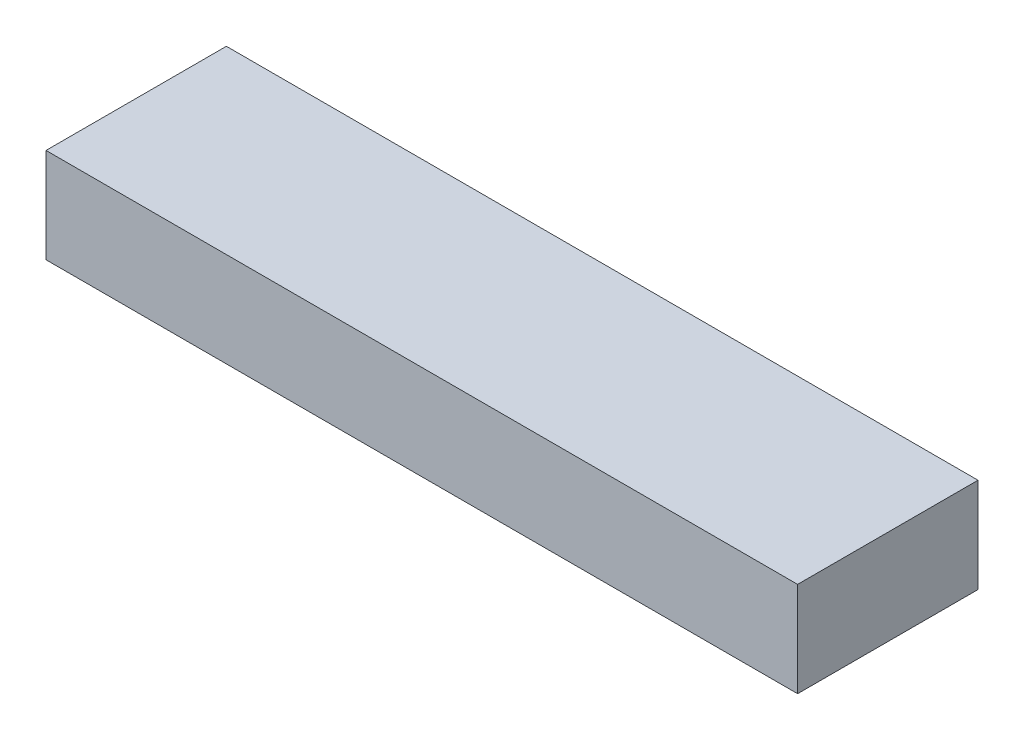
ISO-10303-21;
HEADER;
FILE_DESCRIPTION(('STEP AP214'),'2;1');
FILE_NAME('part.step','',(''),(''),'','','');
FILE_SCHEMA(('AUTOMOTIVE_DESIGN { 1 0 10303 214 1 1 1 1 }'));
ENDSEC;
DATA;
#1=APPLICATION_CONTEXT('core data for automotive mechanical design processes');
#2=APPLICATION_PROTOCOL_DEFINITION('international standard','automotive_design',2000,#1);
#3=PRODUCT_CONTEXT('',#1,'mechanical');
#4=PRODUCT('Part','Part','',(#3));
#5=PRODUCT_RELATED_PRODUCT_CATEGORY('part','',(#4));
#6=PRODUCT_DEFINITION_FORMATION('','',#4);
#7=PRODUCT_DEFINITION_CONTEXT('part definition',#1,'design');
#8=PRODUCT_DEFINITION('design','',#6,#7);
#9=PRODUCT_DEFINITION_SHAPE('','',#8);
#10=(LENGTH_UNIT() NAMED_UNIT(*) SI_UNIT(.MILLI.,.METRE.));
#11=(NAMED_UNIT(*) PLANE_ANGLE_UNIT() SI_UNIT($,.RADIAN.));
#12=(NAMED_UNIT(*) SI_UNIT($,.STERADIAN.) SOLID_ANGLE_UNIT());
#13=UNCERTAINTY_MEASURE_WITH_UNIT(LENGTH_MEASURE(1.E-05),#10,'distance_accuracy_value','');
#14=(GEOMETRIC_REPRESENTATION_CONTEXT(3) GLOBAL_UNCERTAINTY_ASSIGNED_CONTEXT((#13)) GLOBAL_UNIT_ASSIGNED_CONTEXT((#10,
#11,#12)) REPRESENTATION_CONTEXT('',''));
#15=CARTESIAN_POINT('',(0.,0.,0.));
#16=DIRECTION('',(0.,0.,1.));
#17=DIRECTION('',(1.,0.,0.));
#18=AXIS2_PLACEMENT_3D('',#15,#16,#17);
#19=CARTESIAN_POINT('',(12.5,3.15,-3.));
#20=DIRECTION('',(-1.,0.,0.));
#21=DIRECTION('',(0.,0.,1.));
#22=AXIS2_PLACEMENT_3D('',#19,#20,#21);
#23=PLANE('',#22);
#24=DIRECTION('',(0.,0.,-1.));
#25=VECTOR('',#24,1.);
#26=CARTESIAN_POINT('',(12.5,0.,-3.));
#27=LINE('',#26,#25);
#28=CARTESIAN_POINT('',(12.5,0.,3.));
#29=VERTEX_POINT('',#28);
#30=CARTESIAN_POINT('',(12.5,0.,-3.));
#31=VERTEX_POINT('',#30);
#32=EDGE_CURVE('E95',#29,#31,#27,.T.);
#33=ORIENTED_EDGE('',*,*,#32,.T.);
#34=DIRECTION('',(0.,-1.,0.));
#35=VECTOR('',#34,1.);
#36=CARTESIAN_POINT('',(12.5,3.15,-3.));
#37=LINE('',#36,#35);
#38=CARTESIAN_POINT('',(12.5,3.15,-3.));
#39=VERTEX_POINT('',#38);
#40=EDGE_CURVE('E11',#39,#31,#37,.T.);
#41=ORIENTED_EDGE('',*,*,#40,.F.);
#42=DIRECTION('',(0.,0.,-1.));
#43=VECTOR('',#42,1.);
#44=CARTESIAN_POINT('',(12.5,3.15,-3.));
#45=LINE('',#44,#43);
#46=CARTESIAN_POINT('',(12.5,3.15,3.));
#47=VERTEX_POINT('',#46);
#48=EDGE_CURVE('E83',#47,#39,#45,.T.);
#49=ORIENTED_EDGE('',*,*,#48,.F.);
#50=DIRECTION('',(0.,-1.,0.));
#51=VECTOR('',#50,1.);
#52=CARTESIAN_POINT('',(12.5,3.15,3.));
#53=LINE('',#52,#51);
#54=EDGE_CURVE('E91',#47,#29,#53,.T.);
#55=ORIENTED_EDGE('',*,*,#54,.T.);
#56=EDGE_LOOP('',(#33,#41,#49,#55));
#57=FACE_BOUND('',#56,.T.);
#58=ADVANCED_FACE('F32',(#57),#23,.F.);
#59=CARTESIAN_POINT('',(-12.5,3.15,-3.));
#60=DIRECTION('',(0.,0.,1.));
#61=DIRECTION('',(1.,0.,0.));
#62=AXIS2_PLACEMENT_3D('',#59,#60,#61);
#63=PLANE('',#62);
#64=DIRECTION('',(-1.,0.,0.));
#65=VECTOR('',#64,1.);
#66=CARTESIAN_POINT('',(-12.5,0.,-3.));
#67=LINE('',#66,#65);
#68=CARTESIAN_POINT('',(-12.5,0.,-3.));
#69=VERTEX_POINT('',#68);
#70=EDGE_CURVE('E87',#31,#69,#67,.T.);
#71=ORIENTED_EDGE('',*,*,#70,.T.);
#72=DIRECTION('',(0.,-1.,0.));
#73=VECTOR('',#72,1.);
#74=CARTESIAN_POINT('',(-12.5,3.15,-3.));
#75=LINE('',#74,#73);
#76=CARTESIAN_POINT('',(-12.5,3.15,-3.));
#77=VERTEX_POINT('',#76);
#78=EDGE_CURVE('E40',#77,#69,#75,.T.);
#79=ORIENTED_EDGE('',*,*,#78,.F.);
#80=DIRECTION('',(-1.,0.,0.));
#81=VECTOR('',#80,1.);
#82=CARTESIAN_POINT('',(-12.5,3.15,-3.));
#83=LINE('',#82,#81);
#84=EDGE_CURVE('E78',#39,#77,#83,.T.);
#85=ORIENTED_EDGE('',*,*,#84,.F.);
#86=ORIENTED_EDGE('',*,*,#40,.T.);
#87=EDGE_LOOP('',(#71,#79,#85,#86));
#88=FACE_BOUND('',#87,.T.);
#89=ADVANCED_FACE('F86',(#88),#63,.F.);
#90=CARTESIAN_POINT('',(-12.5,3.15,-3.));
#91=DIRECTION('',(1.,0.,0.));
#92=DIRECTION('',(0.,0.,-1.));
#93=AXIS2_PLACEMENT_3D('',#90,#91,#92);
#94=PLANE('',#93);
#95=DIRECTION('',(0.,0.,1.));
#96=VECTOR('',#95,1.);
#97=CARTESIAN_POINT('',(-12.5,0.,-3.));
#98=LINE('',#97,#96);
#99=CARTESIAN_POINT('',(-12.5,0.,3.));
#100=VERTEX_POINT('',#99);
#101=EDGE_CURVE('E65',#69,#100,#98,.T.);
#102=ORIENTED_EDGE('',*,*,#101,.T.);
#103=DIRECTION('',(0.,-1.,0.));
#104=VECTOR('',#103,1.);
#105=CARTESIAN_POINT('',(-12.5,3.15,3.));
#106=LINE('',#105,#104);
#107=CARTESIAN_POINT('',(-12.5,3.15,3.));
#108=VERTEX_POINT('',#107);
#109=EDGE_CURVE('E88',#108,#100,#106,.T.);
#110=ORIENTED_EDGE('',*,*,#109,.F.);
#111=DIRECTION('',(0.,0.,1.));
#112=VECTOR('',#111,1.);
#113=CARTESIAN_POINT('',(-12.5,3.15,-3.));
#114=LINE('',#113,#112);
#115=EDGE_CURVE('E81',#77,#108,#114,.T.);
#116=ORIENTED_EDGE('',*,*,#115,.F.);
#117=ORIENTED_EDGE('',*,*,#78,.T.);
#118=EDGE_LOOP('',(#102,#110,#116,#117));
#119=FACE_BOUND('',#118,.T.);
#120=ADVANCED_FACE('F89',(#119),#94,.F.);
#121=CARTESIAN_POINT('',(-12.5,3.15,3.));
#122=DIRECTION('',(0.,0.,-1.));
#123=DIRECTION('',(-1.,0.,0.));
#124=AXIS2_PLACEMENT_3D('',#121,#122,#123);
#125=PLANE('',#124);
#126=DIRECTION('',(1.,0.,0.));
#127=VECTOR('',#126,1.);
#128=CARTESIAN_POINT('',(-12.5,0.,3.));
#129=LINE('',#128,#127);
#130=EDGE_CURVE('E71',#100,#29,#129,.T.);
#131=ORIENTED_EDGE('',*,*,#130,.T.);
#132=ORIENTED_EDGE('',*,*,#54,.F.);
#133=DIRECTION('',(1.,0.,0.));
#134=VECTOR('',#133,1.);
#135=CARTESIAN_POINT('',(-12.5,3.15,3.));
#136=LINE('',#135,#134);
#137=EDGE_CURVE('E48',#108,#47,#136,.T.);
#138=ORIENTED_EDGE('',*,*,#137,.F.);
#139=ORIENTED_EDGE('',*,*,#109,.T.);
#140=EDGE_LOOP('',(#131,#132,#138,#139));
#141=FACE_BOUND('',#140,.T.);
#142=ADVANCED_FACE('F102',(#141),#125,.F.);
#143=CARTESIAN_POINT('',(0.,3.15,0.));
#144=DIRECTION('',(0.,1.,0.));
#145=DIRECTION('',(0.,0.,1.));
#146=AXIS2_PLACEMENT_3D('',#143,#144,#145);
#147=PLANE('',#146);
#148=ORIENTED_EDGE('',*,*,#48,.T.);
#149=ORIENTED_EDGE('',*,*,#84,.T.);
#150=ORIENTED_EDGE('',*,*,#115,.T.);
#151=ORIENTED_EDGE('',*,*,#137,.T.);
#152=EDGE_LOOP('',(#148,#149,#150,#151));
#153=FACE_BOUND('',#152,.T.);
#154=ADVANCED_FACE('F79',(#153),#147,.T.);
#155=CARTESIAN_POINT('',(0.,0.,0.));
#156=DIRECTION('',(0.,1.,0.));
#157=DIRECTION('',(0.,0.,1.));
#158=AXIS2_PLACEMENT_3D('',#155,#156,#157);
#159=PLANE('',#158);
#160=ORIENTED_EDGE('',*,*,#32,.F.);
#161=ORIENTED_EDGE('',*,*,#130,.F.);
#162=ORIENTED_EDGE('',*,*,#101,.F.);
#163=ORIENTED_EDGE('',*,*,#70,.F.);
#164=EDGE_LOOP('',(#160,#161,#162,#163));
#165=FACE_BOUND('',#164,.T.);
#166=ADVANCED_FACE('F105',(#165),#159,.F.);
#167=CLOSED_SHELL('',(#58,#89,#120,#142,#154,#166));
#168=MANIFOLD_SOLID_BREP('B2',#167);
#169=ADVANCED_BREP_SHAPE_REPRESENTATION('',(#18,#168),#14);
#170=SHAPE_DEFINITION_REPRESENTATION(#9,#169);
ENDSEC;
END-ISO-10303-21;
